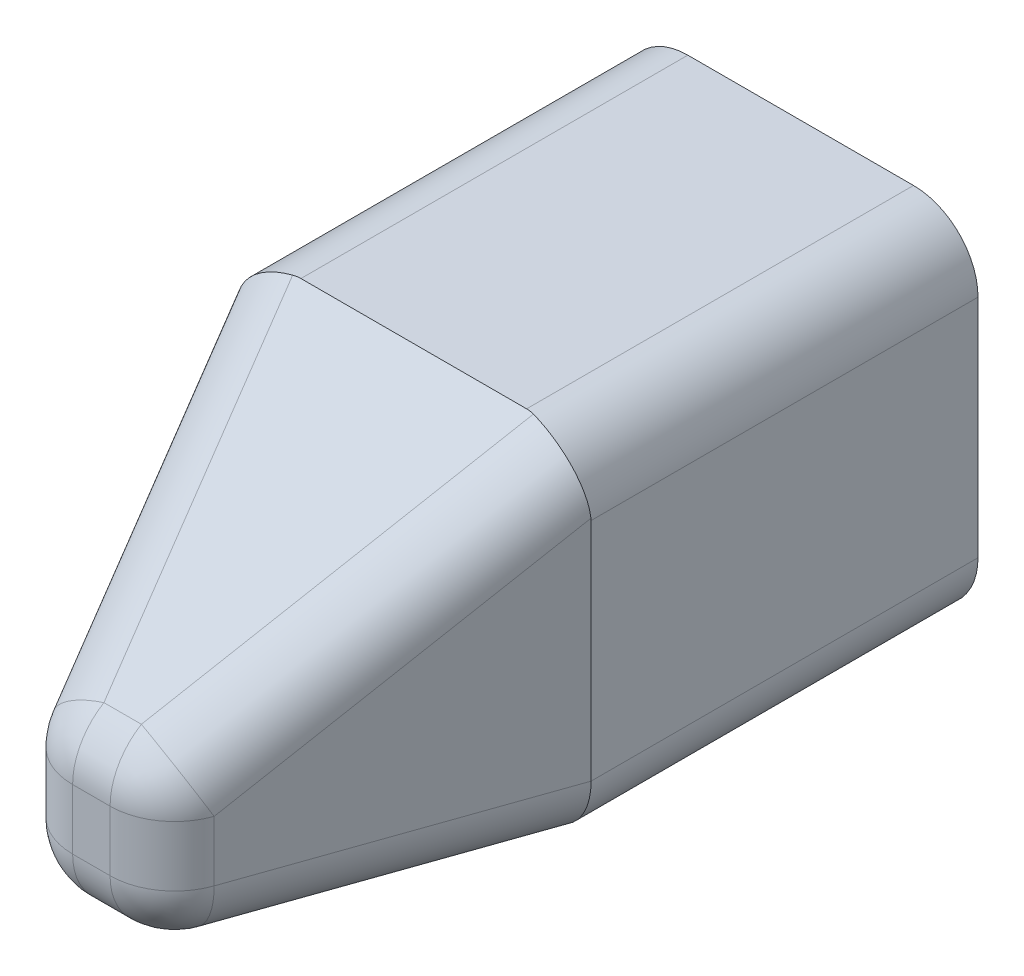
ISO-10303-21;
HEADER;
FILE_DESCRIPTION(('STEP AP214'),'2;1');
FILE_NAME('part.step','',(''),(''),'','','');
FILE_SCHEMA(('AUTOMOTIVE_DESIGN { 1 0 10303 214 1 1 1 1 }'));
ENDSEC;
DATA;
#1=APPLICATION_CONTEXT('core data for automotive mechanical design processes');
#2=APPLICATION_PROTOCOL_DEFINITION('international standard','automotive_design',2000,#1);
#3=PRODUCT_CONTEXT('',#1,'mechanical');
#4=PRODUCT('Part','Part','',(#3));
#5=PRODUCT_RELATED_PRODUCT_CATEGORY('part','',(#4));
#6=PRODUCT_DEFINITION_FORMATION('','',#4);
#7=PRODUCT_DEFINITION_CONTEXT('part definition',#1,'design');
#8=PRODUCT_DEFINITION('design','',#6,#7);
#9=PRODUCT_DEFINITION_SHAPE('','',#8);
#10=(LENGTH_UNIT() NAMED_UNIT(*) SI_UNIT(.MILLI.,.METRE.));
#11=(NAMED_UNIT(*) PLANE_ANGLE_UNIT() SI_UNIT($,.RADIAN.));
#12=(NAMED_UNIT(*) SI_UNIT($,.STERADIAN.) SOLID_ANGLE_UNIT());
#13=UNCERTAINTY_MEASURE_WITH_UNIT(LENGTH_MEASURE(1.E-05),#10,'distance_accuracy_value','');
#14=(GEOMETRIC_REPRESENTATION_CONTEXT(3) GLOBAL_UNCERTAINTY_ASSIGNED_CONTEXT((#13)) GLOBAL_UNIT_ASSIGNED_CONTEXT((#10,
#11,#12)) REPRESENTATION_CONTEXT('',''));
#15=CARTESIAN_POINT('',(0.,0.,0.));
#16=DIRECTION('',(0.,0.,1.));
#17=DIRECTION('',(1.,0.,0.));
#18=AXIS2_PLACEMENT_3D('',#15,#16,#17);
#19=CARTESIAN_POINT('',(0.,0.,100.));
#20=DIRECTION('',(0.,0.,1.));
#21=DIRECTION('',(1.,0.,0.));
#22=AXIS2_PLACEMENT_3D('',#19,#20,#21);
#23=PLANE('',#22);
#24=DIRECTION('',(0.,-1.,0.));
#25=VECTOR('',#24,1.);
#26=CARTESIAN_POINT('',(-5.81037989958291,0.,100.));
#27=LINE('',#26,#25);
#28=CARTESIAN_POINT('',(-5.81037989958291,38.6761924206188,100.));
#29=VERTEX_POINT('',#28);
#30=CARTESIAN_POINT('',(-5.81037989958291,20.,100.));
#31=VERTEX_POINT('',#30);
#32=EDGE_CURVE('E203',#29,#31,#27,.T.);
#33=ORIENTED_EDGE('',*,*,#32,.T.);
#34=DIRECTION('',(1.,0.,0.));
#35=VECTOR('',#34,1.);
#36=CARTESIAN_POINT('',(20.,20.,100.));
#37=LINE('',#36,#35);
#38=CARTESIAN_POINT('',(5.8103798995829,20.,100.));
#39=VERTEX_POINT('',#38);
#40=EDGE_CURVE('E184',#31,#39,#37,.T.);
#41=ORIENTED_EDGE('',*,*,#40,.T.);
#42=DIRECTION('',(0.,1.,0.));
#43=VECTOR('',#42,1.);
#44=CARTESIAN_POINT('',(5.81037989958291,50.,100.));
#45=LINE('',#44,#43);
#46=CARTESIAN_POINT('',(5.81037989958291,38.6761924206188,100.));
#47=VERTEX_POINT('',#46);
#48=EDGE_CURVE('E193',#39,#47,#45,.T.);
#49=ORIENTED_EDGE('',*,*,#48,.T.);
#50=DIRECTION('',(-1.,0.,0.));
#51=VECTOR('',#50,1.);
#52=CARTESIAN_POINT('',(-20.,38.6761924206188,100.));
#53=LINE('',#52,#51);
#54=EDGE_CURVE('E199',#47,#29,#53,.T.);
#55=ORIENTED_EDGE('',*,*,#54,.T.);
#56=EDGE_LOOP('',(#33,#41,#49,#55));
#57=FACE_BOUND('',#56,.T.);
#58=ADVANCED_FACE('F49',(#57),#23,.T.);
#59=CARTESIAN_POINT('',(0.,80.8823529411764,48.5294117647059));
#60=DIRECTION('',(0.,-0.857492925712544,-0.514495755427527));
#61=DIRECTION('',(0.,0.514495755427527,-0.857492925712544));
#62=AXIS2_PLACEMENT_3D('',#59,#60,#61);
#63=PLANE('',#62);
#64=DIRECTION('',(-1.,0.,0.));
#65=VECTOR('',#64,1.);
#66=CARTESIAN_POINT('',(-55.,110.,0.));
#67=LINE('',#66,#65);
#68=CARTESIAN_POINT('',(35.,110.,0.));
#69=VERTEX_POINT('',#68);
#70=CARTESIAN_POINT('',(-35.,110.,0.));
#71=VERTEX_POINT('',#70);
#72=EDGE_CURVE('E263',#69,#71,#67,.T.);
#73=ORIENTED_EDGE('',*,*,#72,.T.);
#74=CARTESIAN_POINT('',(-35.,90.,33.3333333333333));
#75=DIRECTION('',(0.,-0.857492925712544,-0.514495755427527));
#76=DIRECTION('',(0.,-0.514495755427527,0.857492925712544));
#77=AXIS2_PLACEMENT_3D('',#74,#75,#76);
#78=ELLIPSE('',#77,38.873012632302,20.);
#79=CARTESIAN_POINT('',(-37.3322539560543,109.863549317392,0.22741780434641));
#80=VERTEX_POINT('',#79);
#81=EDGE_CURVE('E12',#71,#80,#78,.F.);
#82=ORIENTED_EDGE('',*,*,#81,.T.);
#83=DIRECTION('',(0.287455546823614,-0.492780937411909,0.821301562353182));
#84=VECTOR('',#83,1.);
#85=CARTESIAN_POINT('',(-18.7386956189564,77.988877882367,53.3518701960549));
#86=LINE('',#85,#84);
#87=CARTESIAN_POINT('',(-5.8103798995829,55.8260509348697,90.2899151085505));
#88=VERTEX_POINT('',#87);
#89=EDGE_CURVE('E60',#80,#88,#86,.T.);
#90=ORIENTED_EDGE('',*,*,#89,.T.);
#91=DIRECTION('',(-1.,0.,0.));
#92=VECTOR('',#91,1.);
#93=CARTESIAN_POINT('',(20.,55.8260509348697,90.2899151085505));
#94=LINE('',#93,#92);
#95=CARTESIAN_POINT('',(5.8103798995829,55.8260509348697,90.2899151085505));
#96=VERTEX_POINT('',#95);
#97=EDGE_CURVE('E189',#88,#96,#94,.F.);
#98=ORIENTED_EDGE('',*,*,#97,.T.);
#99=DIRECTION('',(-0.287455546823614,-0.492780937411909,0.821301562353182));
#100=VECTOR('',#99,1.);
#101=CARTESIAN_POINT('',(18.7386956189564,77.988877882367,53.3518701960549));
#102=LINE('',#101,#100);
#103=CARTESIAN_POINT('',(37.3322539560543,109.863549317392,0.22741780434643));
#104=VERTEX_POINT('',#103);
#105=EDGE_CURVE('E73',#96,#104,#102,.F.);
#106=ORIENTED_EDGE('',*,*,#105,.T.);
#107=CARTESIAN_POINT('',(35.,90.,33.3333333333333));
#108=DIRECTION('',(0.,-0.857492925712544,-0.514495755427527));
#109=DIRECTION('',(0.,-0.514495755427527,0.857492925712544));
#110=AXIS2_PLACEMENT_3D('',#107,#108,#109);
#111=ELLIPSE('',#110,38.873012632302,20.);
#112=EDGE_CURVE('E279',#104,#69,#111,.F.);
#113=ORIENTED_EDGE('',*,*,#112,.T.);
#114=EDGE_LOOP('',(#73,#82,#90,#98,#106,#113));
#115=FACE_BOUND('',#114,.T.);
#116=ADVANCED_FACE('F237',(#115),#63,.F.);
#117=CARTESIAN_POINT('',(48.9977728285078,0.,17.1492204899777));
#118=DIRECTION('',(-0.943858356366017,0.,-0.330350424728106));
#119=DIRECTION('',(-0.330350424728106,0.,0.943858356366018));
#120=AXIS2_PLACEMENT_3D('',#117,#118,#119);
#121=PLANE('',#120);
#122=DIRECTION('',(0.,1.,0.));
#123=VECTOR('',#122,1.);
#124=CARTESIAN_POINT('',(24.6875470269032,0.,86.6070084945621));
#125=LINE('',#124,#123);
#126=CARTESIAN_POINT('',(24.6875470269033,38.6761924206188,86.6070084945621));
#127=VERTEX_POINT('',#126);
#128=CARTESIAN_POINT('',(24.6875470269032,20.,86.6070084945621));
#129=VERTEX_POINT('',#128);
#130=EDGE_CURVE('E204',#127,#129,#125,.F.);
#131=ORIENTED_EDGE('',*,*,#130,.T.);
#132=DIRECTION('',(-0.330350424728106,0.,0.943858356366018));
#133=VECTOR('',#132,1.);
#134=CARTESIAN_POINT('',(48.9977728285078,20.,17.1492204899777));
#135=LINE('',#134,#133);
#136=CARTESIAN_POINT('',(55.,20.,0.));
#137=VERTEX_POINT('',#136);
#138=EDGE_CURVE('E272',#129,#137,#135,.F.);
#139=ORIENTED_EDGE('',*,*,#138,.T.);
#140=DIRECTION('',(0.,1.,0.));
#141=VECTOR('',#140,1.);
#142=CARTESIAN_POINT('',(55.,0.,0.));
#143=LINE('',#142,#141);
#144=CARTESIAN_POINT('',(55.,90.,0.));
#145=VERTEX_POINT('',#144);
#146=EDGE_CURVE('E54',#137,#145,#143,.T.);
#147=ORIENTED_EDGE('',*,*,#146,.T.);
#148=CARTESIAN_POINT('',(35.,90.,57.1428571428572));
#149=DIRECTION('',(-0.943858356366017,0.,-0.330350424728106));
#150=DIRECTION('',(-0.330350424728106,0.,0.943858356366018));
#151=AXIS2_PLACEMENT_3D('',#148,#149,#150);
#152=ELLIPSE('',#151,60.5417717154774,20.);
#153=CARTESIAN_POINT('',(54.9902719417751,90.6237208461135,0.0277944520709547));
#154=VERTEX_POINT('',#153);
#155=EDGE_CURVE('E506',#145,#154,#152,.F.);
#156=ORIENTED_EDGE('',*,*,#155,.T.);
#157=DIRECTION('',(-0.287455546823614,-0.492780937411909,0.821301562353182));
#158=VECTOR('',#157,1.);
#159=CARTESIAN_POINT('',(37.6158627462767,60.8390193681161,49.6689635820665));
#160=LINE('',#159,#158);
#161=EDGE_CURVE('E507',#154,#127,#160,.T.);
#162=ORIENTED_EDGE('',*,*,#161,.T.);
#163=EDGE_LOOP('',(#131,#139,#147,#156,#162));
#164=FACE_BOUND('',#163,.T.);
#165=ADVANCED_FACE('F241',(#164),#121,.F.);
#166=CARTESIAN_POINT('',(-48.9977728285078,0.,17.1492204899777));
#167=DIRECTION('',(0.943858356366017,0.,-0.330350424728106));
#168=DIRECTION('',(-0.330350424728106,0.,-0.943858356366017));
#169=AXIS2_PLACEMENT_3D('',#166,#167,#168);
#170=PLANE('',#169);
#171=DIRECTION('',(0.,-1.,0.));
#172=VECTOR('',#171,1.);
#173=CARTESIAN_POINT('',(-55.,0.,0.));
#174=LINE('',#173,#172);
#175=CARTESIAN_POINT('',(-55.,90.,0.));
#176=VERTEX_POINT('',#175);
#177=CARTESIAN_POINT('',(-55.,20.,0.));
#178=VERTEX_POINT('',#177);
#179=EDGE_CURVE('E311',#176,#178,#174,.T.);
#180=ORIENTED_EDGE('',*,*,#179,.T.);
#181=DIRECTION('',(0.330350424728106,0.,0.943858356366017));
#182=VECTOR('',#181,1.);
#183=CARTESIAN_POINT('',(-48.9977728285078,20.,17.1492204899777));
#184=LINE('',#183,#182);
#185=CARTESIAN_POINT('',(-24.6875470269033,20.,86.6070084945621));
#186=VERTEX_POINT('',#185);
#187=EDGE_CURVE('E394',#178,#186,#184,.T.);
#188=ORIENTED_EDGE('',*,*,#187,.T.);
#189=DIRECTION('',(0.,-1.,0.));
#190=VECTOR('',#189,1.);
#191=CARTESIAN_POINT('',(-24.6875470269033,50.,86.6070084945621));
#192=LINE('',#191,#190);
#193=CARTESIAN_POINT('',(-24.6875470269033,38.6761924206188,86.6070084945621));
#194=VERTEX_POINT('',#193);
#195=EDGE_CURVE('E211',#186,#194,#192,.F.);
#196=ORIENTED_EDGE('',*,*,#195,.T.);
#197=DIRECTION('',(0.287455546823614,-0.492780937411909,0.821301562353182));
#198=VECTOR('',#197,1.);
#199=CARTESIAN_POINT('',(-37.6158627462767,60.8390193681161,49.6689635820665));
#200=LINE('',#199,#198);
#201=CARTESIAN_POINT('',(-54.9902719417752,90.6237208461135,0.0277944520709617));
#202=VERTEX_POINT('',#201);
#203=EDGE_CURVE('E390',#194,#202,#200,.F.);
#204=ORIENTED_EDGE('',*,*,#203,.T.);
#205=CARTESIAN_POINT('',(-35.,90.,57.1428571428572));
#206=DIRECTION('',(0.943858356366017,0.,-0.330350424728106));
#207=DIRECTION('',(0.330350424728106,0.,0.943858356366017));
#208=AXIS2_PLACEMENT_3D('',#205,#206,#207);
#209=ELLIPSE('',#208,60.5417717154774,20.);
#210=EDGE_CURVE('E392',#202,#176,#209,.F.);
#211=ORIENTED_EDGE('',*,*,#210,.T.);
#212=EDGE_LOOP('',(#180,#188,#196,#204,#211));
#213=FACE_BOUND('',#212,.T.);
#214=ADVANCED_FACE('F475',(#213),#170,.F.);
#215=CARTESIAN_POINT('',(0.,0.,0.));
#216=DIRECTION('',(0.,1.,0.));
#217=DIRECTION('',(-1.,0.,0.));
#218=AXIS2_PLACEMENT_3D('',#215,#216,#217);
#219=PLANE('',#218);
#220=DIRECTION('',(0.330350424728106,0.,0.943858356366017));
#221=VECTOR('',#220,1.);
#222=CARTESIAN_POINT('',(-30.1206057011874,0.,10.5422119954156));
#223=LINE('',#222,#221);
#224=CARTESIAN_POINT('',(-5.81037989958289,0.,80.));
#225=VERTEX_POINT('',#224);
#226=CARTESIAN_POINT('',(-35.,0.,-3.39891457262025));
#227=VERTEX_POINT('',#226);
#228=EDGE_CURVE('E378',#225,#227,#223,.F.);
#229=ORIENTED_EDGE('',*,*,#228,.T.);
#230=DIRECTION('',(0.,0.,1.));
#231=VECTOR('',#230,1.);
#232=CARTESIAN_POINT('',(-35.,0.,0.));
#233=LINE('',#232,#231);
#234=CARTESIAN_POINT('',(-35.,0.,-120.));
#235=VERTEX_POINT('',#234);
#236=EDGE_CURVE('E380',#227,#235,#233,.F.);
#237=ORIENTED_EDGE('',*,*,#236,.T.);
#238=DIRECTION('',(-1.,0.,0.));
#239=VECTOR('',#238,1.);
#240=CARTESIAN_POINT('',(55.,0.,-120.));
#241=LINE('',#240,#239);
#242=CARTESIAN_POINT('',(35.,0.,-120.));
#243=VERTEX_POINT('',#242);
#244=EDGE_CURVE('E292',#243,#235,#241,.T.);
#245=ORIENTED_EDGE('',*,*,#244,.F.);
#246=DIRECTION('',(0.,0.,1.));
#247=VECTOR('',#246,1.);
#248=CARTESIAN_POINT('',(35.,0.,0.));
#249=LINE('',#248,#247);
#250=CARTESIAN_POINT('',(35.,0.,-3.39891457262031));
#251=VERTEX_POINT('',#250);
#252=EDGE_CURVE('E376',#243,#251,#249,.T.);
#253=ORIENTED_EDGE('',*,*,#252,.T.);
#254=DIRECTION('',(-0.330350424728106,0.,0.943858356366018));
#255=VECTOR('',#254,1.);
#256=CARTESIAN_POINT('',(30.1206057011874,0.,10.5422119954156));
#257=LINE('',#256,#255);
#258=CARTESIAN_POINT('',(5.81037989958291,0.,80.));
#259=VERTEX_POINT('',#258);
#260=EDGE_CURVE('E372',#251,#259,#257,.T.);
#261=ORIENTED_EDGE('',*,*,#260,.T.);
#262=DIRECTION('',(1.,0.,0.));
#263=VECTOR('',#262,1.);
#264=CARTESIAN_POINT('',(-20.,0.,80.));
#265=LINE('',#264,#263);
#266=EDGE_CURVE('E187',#259,#225,#265,.F.);
#267=ORIENTED_EDGE('',*,*,#266,.T.);
#268=EDGE_LOOP('',(#229,#237,#245,#253,#261,#267));
#269=FACE_BOUND('',#268,.T.);
#270=ADVANCED_FACE('F438',(#269),#219,.F.);
#271=CARTESIAN_POINT('',(0.,38.6761924206188,80.));
#272=DIRECTION('',(1.,0.,0.));
#273=DIRECTION('',(0.,1.,0.));
#274=AXIS2_PLACEMENT_3D('',#271,#272,#273);
#275=CYLINDRICAL_SURFACE('',#274,20.);
#276=ORIENTED_EDGE('',*,*,#97,.F.);
#277=CARTESIAN_POINT('',(-5.81037989958291,38.6761924206188,80.));
#278=DIRECTION('',(1.,0.,0.));
#279=DIRECTION('',(0.,1.,0.));
#280=AXIS2_PLACEMENT_3D('',#277,#278,#279);
#281=CIRCLE('',#280,20.);
#282=EDGE_CURVE('E350',#88,#29,#281,.T.);
#283=ORIENTED_EDGE('',*,*,#282,.T.);
#284=ORIENTED_EDGE('',*,*,#54,.F.);
#285=CARTESIAN_POINT('',(5.81037989958291,38.6761924206188,80.));
#286=DIRECTION('',(1.,0.,0.));
#287=DIRECTION('',(0.,1.,0.));
#288=AXIS2_PLACEMENT_3D('',#285,#286,#287);
#289=CIRCLE('',#288,20.);
#290=EDGE_CURVE('E175',#47,#96,#289,.F.);
#291=ORIENTED_EDGE('',*,*,#290,.T.);
#292=EDGE_LOOP('',(#276,#283,#284,#291));
#293=FACE_BOUND('',#292,.T.);
#294=ADVANCED_FACE('F445',(#293),#275,.T.);
#295=CARTESIAN_POINT('',(-5.81037989958291,0.,80.));
#296=DIRECTION('',(0.,1.,0.));
#297=DIRECTION('',(0.,0.,1.));
#298=AXIS2_PLACEMENT_3D('',#295,#296,#297);
#299=CYLINDRICAL_SURFACE('',#298,20.);
#300=ORIENTED_EDGE('',*,*,#195,.F.);
#301=CARTESIAN_POINT('',(-5.81037989958291,20.,80.));
#302=DIRECTION('',(0.,1.,0.));
#303=DIRECTION('',(0.,0.,1.));
#304=AXIS2_PLACEMENT_3D('',#301,#302,#303);
#305=CIRCLE('',#304,20.);
#306=EDGE_CURVE('E346',#186,#31,#305,.T.);
#307=ORIENTED_EDGE('',*,*,#306,.T.);
#308=ORIENTED_EDGE('',*,*,#32,.F.);
#309=CARTESIAN_POINT('',(-5.81037989958291,38.6761924206188,80.));
#310=DIRECTION('',(0.,1.,0.));
#311=DIRECTION('',(0.,0.,1.));
#312=AXIS2_PLACEMENT_3D('',#309,#310,#311);
#313=CIRCLE('',#312,20.);
#314=EDGE_CURVE('E344',#29,#194,#313,.F.);
#315=ORIENTED_EDGE('',*,*,#314,.T.);
#316=EDGE_LOOP('',(#300,#307,#308,#315));
#317=FACE_BOUND('',#316,.T.);
#318=ADVANCED_FACE('F343',(#317),#299,.T.);
#319=CARTESIAN_POINT('',(5.8103798995829,0.,80.));
#320=DIRECTION('',(0.,-1.,0.));
#321=DIRECTION('',(1.,0.,0.));
#322=AXIS2_PLACEMENT_3D('',#319,#320,#321);
#323=CYLINDRICAL_SURFACE('',#322,20.);
#324=ORIENTED_EDGE('',*,*,#48,.F.);
#325=CARTESIAN_POINT('',(5.8103798995829,20.,80.));
#326=DIRECTION('',(0.,-1.,0.));
#327=DIRECTION('',(1.,0.,0.));
#328=AXIS2_PLACEMENT_3D('',#325,#326,#327);
#329=CIRCLE('',#328,20.);
#330=EDGE_CURVE('E165',#39,#129,#329,.F.);
#331=ORIENTED_EDGE('',*,*,#330,.T.);
#332=ORIENTED_EDGE('',*,*,#130,.F.);
#333=CARTESIAN_POINT('',(5.81037989958291,38.6761924206188,80.));
#334=DIRECTION('',(0.,-1.,0.));
#335=DIRECTION('',(1.,0.,0.));
#336=AXIS2_PLACEMENT_3D('',#333,#334,#335);
#337=CIRCLE('',#336,20.);
#338=EDGE_CURVE('E176',#127,#47,#337,.T.);
#339=ORIENTED_EDGE('',*,*,#338,.T.);
#340=EDGE_LOOP('',(#324,#331,#332,#339));
#341=FACE_BOUND('',#340,.T.);
#342=ADVANCED_FACE('F194',(#341),#323,.T.);
#343=CARTESIAN_POINT('',(0.,20.,80.));
#344=DIRECTION('',(-1.,0.,0.));
#345=DIRECTION('',(0.,-1.,0.));
#346=AXIS2_PLACEMENT_3D('',#343,#344,#345);
#347=CYLINDRICAL_SURFACE('',#346,20.);
#348=ORIENTED_EDGE('',*,*,#40,.F.);
#349=CARTESIAN_POINT('',(-5.81037989958291,20.,80.));
#350=DIRECTION('',(-1.,0.,0.));
#351=DIRECTION('',(0.,-1.,0.));
#352=AXIS2_PLACEMENT_3D('',#349,#350,#351);
#353=CIRCLE('',#352,20.);
#354=EDGE_CURVE('E188',#31,#225,#353,.F.);
#355=ORIENTED_EDGE('',*,*,#354,.T.);
#356=ORIENTED_EDGE('',*,*,#266,.F.);
#357=CARTESIAN_POINT('',(5.8103798995829,20.,80.));
#358=DIRECTION('',(-1.,0.,0.));
#359=DIRECTION('',(0.,-1.,0.));
#360=AXIS2_PLACEMENT_3D('',#357,#358,#359);
#361=CIRCLE('',#360,20.);
#362=EDGE_CURVE('E168',#259,#39,#361,.T.);
#363=ORIENTED_EDGE('',*,*,#362,.T.);
#364=EDGE_LOOP('',(#348,#355,#356,#363));
#365=FACE_BOUND('',#364,.T.);
#366=ADVANCED_FACE('F181',(#365),#347,.T.);
#367=CARTESIAN_POINT('',(-55.,0.,-120.));
#368=DIRECTION('',(1.,0.,0.));
#369=DIRECTION('',(0.,0.,-1.));
#370=AXIS2_PLACEMENT_3D('',#367,#368,#369);
#371=PLANE('',#370);
#372=DIRECTION('',(0.,1.,0.));
#373=VECTOR('',#372,1.);
#374=CARTESIAN_POINT('',(-55.,0.,-120.));
#375=LINE('',#374,#373);
#376=CARTESIAN_POINT('',(-55.,20.,-120.));
#377=VERTEX_POINT('',#376);
#378=CARTESIAN_POINT('',(-55.,90.,-120.));
#379=VERTEX_POINT('',#378);
#380=EDGE_CURVE('E480',#377,#379,#375,.T.);
#381=ORIENTED_EDGE('',*,*,#380,.F.);
#382=DIRECTION('',(0.,0.,1.));
#383=VECTOR('',#382,1.);
#384=CARTESIAN_POINT('',(-55.,20.,-120.));
#385=LINE('',#384,#383);
#386=EDGE_CURVE('E368',#377,#178,#385,.T.);
#387=ORIENTED_EDGE('',*,*,#386,.T.);
#388=ORIENTED_EDGE('',*,*,#179,.F.);
#389=DIRECTION('',(0.,0.,1.));
#390=VECTOR('',#389,1.);
#391=CARTESIAN_POINT('',(-55.,90.,-120.));
#392=LINE('',#391,#390);
#393=EDGE_CURVE('E360',#176,#379,#392,.F.);
#394=ORIENTED_EDGE('',*,*,#393,.T.);
#395=EDGE_LOOP('',(#381,#387,#388,#394));
#396=FACE_BOUND('',#395,.T.);
#397=ADVANCED_FACE('F224',(#396),#371,.F.);
#398=CARTESIAN_POINT('',(-55.,110.,-120.));
#399=DIRECTION('',(0.,-1.,0.));
#400=DIRECTION('',(0.,0.,-1.));
#401=AXIS2_PLACEMENT_3D('',#398,#399,#400);
#402=PLANE('',#401);
#403=DIRECTION('',(1.,0.,0.));
#404=VECTOR('',#403,1.);
#405=CARTESIAN_POINT('',(-55.,110.,-120.));
#406=LINE('',#405,#404);
#407=CARTESIAN_POINT('',(-35.,110.,-120.));
#408=VERTEX_POINT('',#407);
#409=CARTESIAN_POINT('',(35.,110.,-120.));
#410=VERTEX_POINT('',#409);
#411=EDGE_CURVE('E485',#408,#410,#406,.T.);
#412=ORIENTED_EDGE('',*,*,#411,.F.);
#413=DIRECTION('',(0.,0.,1.));
#414=VECTOR('',#413,1.);
#415=CARTESIAN_POINT('',(-35.,110.,-120.));
#416=LINE('',#415,#414);
#417=EDGE_CURVE('E271',#408,#71,#416,.T.);
#418=ORIENTED_EDGE('',*,*,#417,.T.);
#419=ORIENTED_EDGE('',*,*,#72,.F.);
#420=DIRECTION('',(0.,0.,1.));
#421=VECTOR('',#420,1.);
#422=CARTESIAN_POINT('',(35.,110.,-120.));
#423=LINE('',#422,#421);
#424=EDGE_CURVE('E269',#69,#410,#423,.F.);
#425=ORIENTED_EDGE('',*,*,#424,.T.);
#426=EDGE_LOOP('',(#412,#418,#419,#425));
#427=FACE_BOUND('',#426,.T.);
#428=ADVANCED_FACE('F233',(#427),#402,.F.);
#429=CARTESIAN_POINT('',(55.,110.,-120.));
#430=DIRECTION('',(-1.,0.,0.));
#431=DIRECTION('',(0.,0.,1.));
#432=AXIS2_PLACEMENT_3D('',#429,#430,#431);
#433=PLANE('',#432);
#434=ORIENTED_EDGE('',*,*,#146,.F.);
#435=DIRECTION('',(0.,0.,1.));
#436=VECTOR('',#435,1.);
#437=CARTESIAN_POINT('',(55.,20.,-120.));
#438=LINE('',#437,#436);
#439=CARTESIAN_POINT('',(55.,20.,-120.));
#440=VERTEX_POINT('',#439);
#441=EDGE_CURVE('E498',#137,#440,#438,.F.);
#442=ORIENTED_EDGE('',*,*,#441,.T.);
#443=DIRECTION('',(0.,-1.,0.));
#444=VECTOR('',#443,1.);
#445=CARTESIAN_POINT('',(55.,110.,-120.));
#446=LINE('',#445,#444);
#447=CARTESIAN_POINT('',(55.,90.,-120.));
#448=VERTEX_POINT('',#447);
#449=EDGE_CURVE('E487',#448,#440,#446,.T.);
#450=ORIENTED_EDGE('',*,*,#449,.F.);
#451=DIRECTION('',(0.,0.,1.));
#452=VECTOR('',#451,1.);
#453=CARTESIAN_POINT('',(55.,90.,-120.));
#454=LINE('',#453,#452);
#455=EDGE_CURVE('E398',#448,#145,#454,.T.);
#456=ORIENTED_EDGE('',*,*,#455,.T.);
#457=EDGE_LOOP('',(#434,#442,#450,#456));
#458=FACE_BOUND('',#457,.T.);
#459=ADVANCED_FACE('F412',(#458),#433,.F.);
#460=CARTESIAN_POINT('',(0.,0.,-120.));
#461=DIRECTION('',(0.,0.,-1.));
#462=DIRECTION('',(-1.,0.,0.));
#463=AXIS2_PLACEMENT_3D('',#460,#461,#462);
#464=PLANE('',#463);
#465=ORIENTED_EDGE('',*,*,#244,.T.);
#466=CARTESIAN_POINT('',(-35.,20.,-120.));
#467=DIRECTION('',(0.,0.,-1.));
#468=DIRECTION('',(-1.,0.,0.));
#469=AXIS2_PLACEMENT_3D('',#466,#467,#468);
#470=CIRCLE('',#469,20.);
#471=EDGE_CURVE('E388',#235,#377,#470,.T.);
#472=ORIENTED_EDGE('',*,*,#471,.T.);
#473=ORIENTED_EDGE('',*,*,#380,.T.);
#474=CARTESIAN_POINT('',(-35.,90.,-120.));
#475=DIRECTION('',(0.,0.,-1.));
#476=DIRECTION('',(-1.,0.,0.));
#477=AXIS2_PLACEMENT_3D('',#474,#475,#476);
#478=CIRCLE('',#477,20.);
#479=EDGE_CURVE('E384',#379,#408,#478,.T.);
#480=ORIENTED_EDGE('',*,*,#479,.T.);
#481=ORIENTED_EDGE('',*,*,#411,.T.);
#482=CARTESIAN_POINT('',(35.,90.,-120.));
#483=DIRECTION('',(0.,0.,-1.));
#484=DIRECTION('',(-1.,0.,0.));
#485=AXIS2_PLACEMENT_3D('',#482,#483,#484);
#486=CIRCLE('',#485,20.);
#487=EDGE_CURVE('E382',#410,#448,#486,.T.);
#488=ORIENTED_EDGE('',*,*,#487,.T.);
#489=ORIENTED_EDGE('',*,*,#449,.T.);
#490=CARTESIAN_POINT('',(35.,20.,-120.));
#491=DIRECTION('',(0.,0.,-1.));
#492=DIRECTION('',(-1.,0.,0.));
#493=AXIS2_PLACEMENT_3D('',#490,#491,#492);
#494=CIRCLE('',#493,20.);
#495=EDGE_CURVE('E386',#440,#243,#494,.T.);
#496=ORIENTED_EDGE('',*,*,#495,.T.);
#497=EDGE_LOOP('',(#465,#472,#473,#480,#481,#488,#489,#496));
#498=FACE_BOUND('',#497,.T.);
#499=ADVANCED_FACE('F421',(#498),#464,.T.);
#500=CARTESIAN_POINT('',(-35.,20.,-120.));
#501=DIRECTION('',(0.,0.,1.));
#502=DIRECTION('',(0.,-1.,0.));
#503=AXIS2_PLACEMENT_3D('',#500,#501,#502);
#504=CYLINDRICAL_SURFACE('',#503,20.);
#505=ORIENTED_EDGE('',*,*,#471,.F.);
#506=ORIENTED_EDGE('',*,*,#236,.F.);
#507=CARTESIAN_POINT('',(-35.,20.,-3.39891457262029));
#508=DIRECTION('',(0.167543492314656,0.,0.985864685533978));
#509=DIRECTION('',(0.985864685533978,0.,-0.167543492314656));
#510=AXIS2_PLACEMENT_3D('',#507,#508,#509);
#511=ELLIPSE('',#510,20.2867597282555,20.);
#512=EDGE_CURVE('E288',#178,#227,#511,.T.);
#513=ORIENTED_EDGE('',*,*,#512,.F.);
#514=ORIENTED_EDGE('',*,*,#386,.F.);
#515=EDGE_LOOP('',(#505,#506,#513,#514));
#516=FACE_BOUND('',#515,.T.);
#517=ADVANCED_FACE('F423',(#516),#504,.T.);
#518=CARTESIAN_POINT('',(-30.1206057011874,20.,10.5422119954156));
#519=DIRECTION('',(0.330350424728106,0.,0.943858356366017));
#520=DIRECTION('',(0.943858356366017,0.,-0.330350424728106));
#521=AXIS2_PLACEMENT_3D('',#518,#519,#520);
#522=CYLINDRICAL_SURFACE('',#521,20.);
#523=CARTESIAN_POINT('',(-5.81037989958291,20.,80.));
#524=DIRECTION('',(0.330350424728106,0.,0.943858356366017));
#525=DIRECTION('',(0.943858356366018,0.,-0.330350424728106));
#526=AXIS2_PLACEMENT_3D('',#523,#524,#525);
#527=CIRCLE('',#526,20.);
#528=EDGE_CURVE('E286',#186,#225,#527,.T.);
#529=ORIENTED_EDGE('',*,*,#528,.F.);
#530=ORIENTED_EDGE('',*,*,#187,.F.);
#531=ORIENTED_EDGE('',*,*,#512,.T.);
#532=ORIENTED_EDGE('',*,*,#228,.F.);
#533=EDGE_LOOP('',(#529,#530,#531,#532));
#534=FACE_BOUND('',#533,.T.);
#535=ADVANCED_FACE('F428',(#534),#522,.T.);
#536=CARTESIAN_POINT('',(-5.81037989958291,20.,80.));
#537=DIRECTION('',(0.,0.,1.));
#538=DIRECTION('',(1.,0.,0.));
#539=AXIS2_PLACEMENT_3D('',#536,#537,#538);
#540=SPHERICAL_SURFACE('',#539,20.);
#541=ORIENTED_EDGE('',*,*,#354,.F.);
#542=ORIENTED_EDGE('',*,*,#306,.F.);
#543=ORIENTED_EDGE('',*,*,#528,.T.);
#544=EDGE_LOOP('',(#541,#542,#543));
#545=FACE_BOUND('',#544,.T.);
#546=ADVANCED_FACE('F448',(#545),#540,.T.);
#547=CARTESIAN_POINT('',(35.,20.,0.));
#548=DIRECTION('',(0.,0.,1.));
#549=DIRECTION('',(0.,-1.,0.));
#550=AXIS2_PLACEMENT_3D('',#547,#548,#549);
#551=CYLINDRICAL_SURFACE('',#550,20.);
#552=ORIENTED_EDGE('',*,*,#495,.F.);
#553=ORIENTED_EDGE('',*,*,#441,.F.);
#554=CARTESIAN_POINT('',(35.,20.,-3.39891457262031));
#555=DIRECTION('',(-0.167543492314656,0.,0.985864685533978));
#556=DIRECTION('',(-0.985864685533978,0.,-0.167543492314656));
#557=AXIS2_PLACEMENT_3D('',#554,#555,#556);
#558=ELLIPSE('',#557,20.2867597282555,20.);
#559=EDGE_CURVE('E289',#251,#137,#558,.T.);
#560=ORIENTED_EDGE('',*,*,#559,.F.);
#561=ORIENTED_EDGE('',*,*,#252,.F.);
#562=EDGE_LOOP('',(#552,#553,#560,#561));
#563=FACE_BOUND('',#562,.T.);
#564=ADVANCED_FACE('F451',(#563),#551,.T.);
#565=CARTESIAN_POINT('',(30.1206057011874,20.,10.5422119954156));
#566=DIRECTION('',(-0.330350424728106,0.,0.943858356366018));
#567=DIRECTION('',(0.943858356366017,0.,0.330350424728106));
#568=AXIS2_PLACEMENT_3D('',#565,#566,#567);
#569=CYLINDRICAL_SURFACE('',#568,20.);
#570=CARTESIAN_POINT('',(5.8103798995829,20.,80.));
#571=DIRECTION('',(-0.330350424728106,0.,0.943858356366018));
#572=DIRECTION('',(0.943858356366018,0.,0.330350424728106));
#573=AXIS2_PLACEMENT_3D('',#570,#571,#572);
#574=CIRCLE('',#573,20.);
#575=EDGE_CURVE('E170',#259,#129,#574,.T.);
#576=ORIENTED_EDGE('',*,*,#575,.F.);
#577=ORIENTED_EDGE('',*,*,#260,.F.);
#578=ORIENTED_EDGE('',*,*,#559,.T.);
#579=ORIENTED_EDGE('',*,*,#138,.F.);
#580=EDGE_LOOP('',(#576,#577,#578,#579));
#581=FACE_BOUND('',#580,.T.);
#582=ADVANCED_FACE('F458',(#581),#569,.T.);
#583=CARTESIAN_POINT('',(5.8103798995829,20.,80.));
#584=DIRECTION('',(0.,0.,1.));
#585=DIRECTION('',(1.,0.,0.));
#586=AXIS2_PLACEMENT_3D('',#583,#584,#585);
#587=SPHERICAL_SURFACE('',#586,20.);
#588=ORIENTED_EDGE('',*,*,#575,.T.);
#589=ORIENTED_EDGE('',*,*,#330,.F.);
#590=ORIENTED_EDGE('',*,*,#362,.F.);
#591=EDGE_LOOP('',(#588,#589,#590));
#592=FACE_BOUND('',#591,.T.);
#593=ADVANCED_FACE('F167',(#592),#587,.T.);
#594=CARTESIAN_POINT('',(-35.,90.,-120.));
#595=DIRECTION('',(0.,0.,1.));
#596=DIRECTION('',(1.,0.,0.));
#597=AXIS2_PLACEMENT_3D('',#594,#595,#596);
#598=CYLINDRICAL_SURFACE('',#597,20.);
#599=ORIENTED_EDGE('',*,*,#393,.F.);
#600=ORIENTED_EDGE('',*,*,#210,.F.);
#601=CARTESIAN_POINT('',(-37.3322539560543,109.863549317392,0.227417804346411));
#602=CARTESIAN_POINT('',(-37.596499367809,109.832524445672,0.279126846804721));
#603=CARTESIAN_POINT('',(-37.8604459733113,109.79618595576,0.329028153560507));
#604=CARTESIAN_POINT('',(-38.387312291239,109.712870179103,0.425228496313744));
#605=CARTESIAN_POINT('',(-38.6502320108069,109.66589296649,0.471527557409099));
#606=CARTESIAN_POINT('',(-39.4367300638645,109.509001579283,0.605028231493654));
#607=CARTESIAN_POINT('',(-39.9581305911998,109.383117913609,0.686849574556827));
#608=CARTESIAN_POINT('',(-40.9907137965018,109.089246280398,0.836086792455252));
#609=CARTESIAN_POINT('',(-41.5019021782739,108.92128256854,0.903510924766457));
#610=CARTESIAN_POINT('',(-42.2582244752225,108.638419713598,0.99393215928463));
#611=CARTESIAN_POINT('',(-42.5085943750768,108.538976473528,1.02228729197129));
#612=CARTESIAN_POINT('',(-43.0054956552613,108.329885870402,1.0754576259913));
#613=CARTESIAN_POINT('',(-43.252026022955,108.220235866889,1.10027190708902));
#614=CARTESIAN_POINT('',(-43.9854772011041,107.876044158309,1.16945920424002));
#615=CARTESIAN_POINT('',(-44.4659092550854,107.626391126748,1.20853516895157));
#616=CARTESIAN_POINT('',(-45.4056241733755,107.08847829835,1.27278852700607));
#617=CARTESIAN_POINT('',(-45.8649070688978,106.800218558494,1.29796594086217));
#618=CARTESIAN_POINT('',(-46.5352488684738,106.340486412127,1.32559180680464));
#619=CARTESIAN_POINT('',(-46.7555910287797,106.182691785969,1.33311029329584));
#620=CARTESIAN_POINT('',(-47.1896822002321,105.858280265304,1.34483221660301));
#621=CARTESIAN_POINT('',(-47.4034329009033,105.691665661787,1.34903650981577));
#622=CARTESIAN_POINT('',(-48.0343226543304,105.178932971435,1.35677898819168));
#623=CARTESIAN_POINT('',(-48.4411480443507,104.819892610692,1.35544874367029));
#624=CARTESIAN_POINT('',(-49.2214972933971,104.072633489804,1.34051589895741));
#625=CARTESIAN_POINT('',(-49.5952253712731,103.684625562822,1.32699530136227));
#626=CARTESIAN_POINT('',(-50.3099320118786,102.880041984293,1.28862023982282));
#627=CARTESIAN_POINT('',(-50.6509104910339,102.463466259848,1.26376574695628));
#628=CARTESIAN_POINT('',(-51.2980410401599,101.604447986688,1.20371153171336));
#629=CARTESIAN_POINT('',(-51.6041738495681,101.161991335145,1.16850612613172));
#630=CARTESIAN_POINT('',(-52.1794796114708,100.25446866235,1.08897527812396));
#631=CARTESIAN_POINT('',(-52.448653000211,99.7894029080488,1.04464994335915));
#632=CARTESIAN_POINT('',(-52.9531004389269,98.8309073357254,0.947452933329641));
#633=CARTESIAN_POINT('',(-53.1876491575216,98.3371104176624,0.894437367098889));
#634=CARTESIAN_POINT('',(-53.6153781644196,97.3325156132284,0.78236535101999));
#635=CARTESIAN_POINT('',(-53.8085533393857,96.8217156344602,0.723308155820943));
#636=CARTESIAN_POINT('',(-54.1522134531588,95.7870188317493,0.60160926238737));
#637=CARTESIAN_POINT('',(-54.302745574601,95.2631371862736,0.538971618747476));
#638=CARTESIAN_POINT('',(-54.5605064432075,94.2051067196068,0.413129466995054));
#639=CARTESIAN_POINT('',(-54.6677530387696,93.6709622255847,0.349925203535184));
#640=CARTESIAN_POINT('',(-54.8189086877008,92.7180088600504,0.241088086180989));
#641=CARTESIAN_POINT('',(-54.8716841245208,92.3006751525001,0.194734975305549));
#642=CARTESIAN_POINT('',(-54.9310253159936,91.6728225507685,0.128799404765099));
#643=CARTESIAN_POINT('',(-54.9474968649377,91.4633952214146,0.107435300812056));
#644=CARTESIAN_POINT('',(-54.9738407134112,91.0439551640242,0.0663083910985609));
#645=CARTESIAN_POINT('',(-54.9837125627492,90.8339423970336,0.0465456946572008));
#646=CARTESIAN_POINT('',(-54.9902719417752,90.6237208461135,0.0277944520709768));
#647=B_SPLINE_CURVE_WITH_KNOTS('',3,(#601,#602,#603,#604,#605,#606,#607,#608,#609,#610,#611,
#612,#613,#614,#615,#616,#617,#618,#619,#620,#621,#622,#623,#624,#625,#626,#627,#628,#629,#630,
#631,#632,#633,#634,#635,#636,#637,#638,#639,#640,#641,#642,#643,#644,#645,#646),.UNSPECIFIED.,
.F.,.F.,(4,2,2,2,2,2,2,2,2,2,2,2,2,2,2,2,2,2,2,2,2,2,4),(0.,0.813001123901735,1.62599658287815,
3.25173204037994,4.87653254278569,5.68897154992059,6.50162131961404,8.12804127977044,
9.75445883945663,10.5676058562685,11.3805426846835,13.0062397042098,14.6210818426016,
16.2359281018269,17.851662659139,19.4673781437021,21.1132077522574,22.7592406509073,
24.4034451099149,26.0469709016381,27.3157123468263,27.9490869264181,28.5825047065726),.UNSPECIFIED.);
#648=EDGE_CURVE('E296',#80,#202,#647,.T.);
#649=ORIENTED_EDGE('',*,*,#648,.F.);
#650=ORIENTED_EDGE('',*,*,#81,.F.);
#651=ORIENTED_EDGE('',*,*,#417,.F.);
#652=ORIENTED_EDGE('',*,*,#479,.F.);
#653=EDGE_LOOP('',(#599,#600,#649,#650,#651,#652));
#654=FACE_BOUND('',#653,.T.);
#655=ADVANCED_FACE('F317',(#654),#598,.T.);
#656=CARTESIAN_POINT('',(-18.7386956189564,60.8390193681161,43.0619550875044));
#657=DIRECTION('',(0.287455546823614,-0.492780937411909,0.821301562353182));
#658=DIRECTION('',(0.,-0.857492925712544,-0.514495755427526));
#659=AXIS2_PLACEMENT_3D('',#656,#657,#658);
#660=CYLINDRICAL_SURFACE('',#659,20.);
#661=CARTESIAN_POINT('',(-5.81037989958291,38.6761924206188,80.));
#662=DIRECTION('',(0.287455546823614,-0.492780937411909,0.821301562353181));
#663=DIRECTION('',(0.,-0.857492925712544,-0.514495755427527));
#664=AXIS2_PLACEMENT_3D('',#661,#662,#663);
#665=CIRCLE('',#664,20.);
#666=EDGE_CURVE('E301',#88,#194,#665,.T.);
#667=ORIENTED_EDGE('',*,*,#666,.F.);
#668=ORIENTED_EDGE('',*,*,#89,.F.);
#669=ORIENTED_EDGE('',*,*,#648,.T.);
#670=ORIENTED_EDGE('',*,*,#203,.F.);
#671=EDGE_LOOP('',(#667,#668,#669,#670));
#672=FACE_BOUND('',#671,.T.);
#673=ADVANCED_FACE('F314',(#672),#660,.T.);
#674=CARTESIAN_POINT('',(-5.81037989958291,38.6761924206188,80.));
#675=DIRECTION('',(0.,0.,1.));
#676=DIRECTION('',(1.,0.,0.));
#677=AXIS2_PLACEMENT_3D('',#674,#675,#676);
#678=SPHERICAL_SURFACE('',#677,20.);
#679=ORIENTED_EDGE('',*,*,#314,.F.);
#680=ORIENTED_EDGE('',*,*,#282,.F.);
#681=ORIENTED_EDGE('',*,*,#666,.T.);
#682=EDGE_LOOP('',(#679,#680,#681));
#683=FACE_BOUND('',#682,.T.);
#684=ADVANCED_FACE('F349',(#683),#678,.T.);
#685=CARTESIAN_POINT('',(35.,90.,-120.));
#686=DIRECTION('',(0.,0.,1.));
#687=DIRECTION('',(1.,0.,0.));
#688=AXIS2_PLACEMENT_3D('',#685,#686,#687);
#689=CYLINDRICAL_SURFACE('',#688,20.);
#690=ORIENTED_EDGE('',*,*,#424,.F.);
#691=ORIENTED_EDGE('',*,*,#112,.F.);
#692=CARTESIAN_POINT('',(54.9902719417752,90.6237208461135,0.0277944520709559));
#693=CARTESIAN_POINT('',(54.9814860557887,90.9053429694352,0.0529373669596358));
#694=CARTESIAN_POINT('',(54.9667521507024,91.1866066283502,0.0798618782691246));
#695=CARTESIAN_POINT('',(54.9254546516016,91.7479864345577,0.136334605641644));
#696=CARTESIAN_POINT('',(54.8988916789921,92.0281026413482,0.165882683818086));
#697=CARTESIAN_POINT('',(54.83400403312,92.5867644566118,0.226663482520613));
#698=CARTESIAN_POINT('',(54.7956802937512,92.8653101880047,0.257896069121746));
#699=CARTESIAN_POINT('',(54.707352947034,93.4204168803898,0.321326260903201));
#700=CARTESIAN_POINT('',(54.6573491817964,93.6969778144997,0.353523879123581));
#701=CARTESIAN_POINT('',(54.4898739179289,94.5233544157071,0.450648632088402));
#702=CARTESIAN_POINT('',(54.3549592810923,95.069684790984,0.516087401451133));
#703=CARTESIAN_POINT('',(54.0395140214482,96.149246523614,0.644398770224445));
#704=CARTESIAN_POINT('',(53.8589834831622,96.6824779052361,0.707271374389605));
#705=CARTESIAN_POINT('',(53.4532411122045,97.7327187911043,0.827613760846458));
#706=CARTESIAN_POINT('',(53.2280010504967,98.2497178063569,0.885080095725594));
#707=CARTESIAN_POINT('',(52.7343022003473,99.2634984857682,0.992280164883435));
#708=CARTESIAN_POINT('',(52.4658431796967,99.7602800412836,1.042013857613));
#709=CARTESIAN_POINT('',(51.8876504314345,100.729655949294,1.13188149761237));
#710=CARTESIAN_POINT('',(51.5779464401988,101.202267391103,1.17202230333827));
#711=CARTESIAN_POINT('',(50.9192307694347,102.120113992587,1.24125058500384));
#712=CARTESIAN_POINT('',(50.5702200123583,102.565349794335,1.2703383202671));
#713=CARTESIAN_POINT('',(49.8420281522847,103.417245661248,1.31581832849909));
#714=CARTESIAN_POINT('',(49.4635065222792,103.824457584966,1.33243060153511));
#715=CARTESIAN_POINT('',(48.6737104494443,104.606107324761,1.35287076006853));
#716=CARTESIAN_POINT('',(48.2624359982672,104.980545132486,1.35669864230758));
#717=CARTESIAN_POINT('',(47.4099226309213,105.694037217848,1.35080901335809));
#718=CARTESIAN_POINT('',(46.9686698601321,106.033074949016,1.34108519812081));
#719=CARTESIAN_POINT('',(46.2872054771726,106.512912009095,1.31590796174067));
#720=CARTESIAN_POINT('',(46.0567794464134,106.668075228046,1.30574984495905));
#721=CARTESIAN_POINT('',(45.5897375982611,106.968635369692,1.28184433201559));
#722=CARTESIAN_POINT('',(45.3531201997789,107.114029763227,1.26809601081332));
#723=CARTESIAN_POINT('',(44.647724771866,107.527491253573,1.22223342767422));
#724=CARTESIAN_POINT('',(44.1709732904518,107.781563232034,1.18504495424679));
#725=CARTESIAN_POINT('',(43.1995573538094,108.249876721662,1.09661324507121));
#726=CARTESIAN_POINT('',(42.7048930969847,108.464118673828,1.04537016495187));
#727=CARTESIAN_POINT('',(41.9526769270432,108.75453221483,0.957900226094207));
#728=CARTESIAN_POINT('',(41.7003677456566,108.846139191689,0.926994706811106));
#729=CARTESIAN_POINT('',(41.1927495857928,109.018983619081,0.86163868818794));
#730=CARTESIAN_POINT('',(40.9374413255507,109.100223499237,0.827189022882013));
#731=CARTESIAN_POINT('',(40.1678108470155,109.328211935903,0.718519497036571));
#732=CARTESIAN_POINT('',(39.6494850904439,109.459344104523,0.638944631139242));
#733=CARTESIAN_POINT('',(38.8301233256084,109.632192580345,0.502726456494411));
#734=CARTESIAN_POINT('',(38.5311825137674,109.688142780911,0.450874456965544));
#735=CARTESIAN_POINT('',(37.9323765548547,109.786183109227,0.342594134777454));
#736=CARTESIAN_POINT('',(37.6325137113068,109.828295698975,0.286173415790202));
#737=CARTESIAN_POINT('',(37.3322539560543,109.863549317392,0.227417804346433));
#738=B_SPLINE_CURVE_WITH_KNOTS('',3,(#692,#693,#694,#695,#696,#697,#698,#699,#700,#701,#702,
#703,#704,#705,#706,#707,#708,#709,#710,#711,#712,#713,#714,#715,#716,#717,#718,#719,#720,#721,
#722,#723,#724,#725,#726,#727,#728,#729,#730,#731,#732,#733,#734,#735,#736,#737),.UNSPECIFIED.,
.F.,.F.,(4,2,2,2,2,2,2,2,2,2,2,2,2,2,2,2,2,2,2,2,2,2,4),(0.,0.848547052423738,1.69704953419791,
2.54548465589115,3.39393124729575,5.09136701945926,6.78879964647918,8.4873074400109,
10.1858243596718,11.8831232633469,13.5803823430808,15.2469586965536,16.9135354747845,
18.5808877786475,19.4146127434286,20.2485527354001,21.8710043320853,23.4934379638405,
24.303818792938,25.1140093516821,26.7334302321479,27.6586945809532,28.5824494815604),.UNSPECIFIED.);
#739=EDGE_CURVE('E303',#154,#104,#738,.T.);
#740=ORIENTED_EDGE('',*,*,#739,.F.);
#741=ORIENTED_EDGE('',*,*,#155,.F.);
#742=ORIENTED_EDGE('',*,*,#455,.F.);
#743=ORIENTED_EDGE('',*,*,#487,.F.);
#744=EDGE_LOOP('',(#690,#691,#740,#741,#742,#743));
#745=FACE_BOUND('',#744,.T.);
#746=ADVANCED_FACE('F51',(#745),#689,.T.);
#747=CARTESIAN_POINT('',(18.7386956189564,60.8390193681161,43.0619550875044));
#748=DIRECTION('',(-0.287455546823614,-0.492780937411909,0.821301562353182));
#749=DIRECTION('',(0.,-0.857492925712544,-0.514495755427527));
#750=AXIS2_PLACEMENT_3D('',#747,#748,#749);
#751=CYLINDRICAL_SURFACE('',#750,20.);
#752=CARTESIAN_POINT('',(5.81037989958291,38.6761924206188,80.));
#753=DIRECTION('',(-0.287455546823614,-0.49278093741191,0.821301562353182));
#754=DIRECTION('',(0.,-0.857492925712544,-0.514495755427527));
#755=AXIS2_PLACEMENT_3D('',#752,#753,#754);
#756=CIRCLE('',#755,20.);
#757=EDGE_CURVE('E334',#127,#96,#756,.T.);
#758=ORIENTED_EDGE('',*,*,#757,.F.);
#759=ORIENTED_EDGE('',*,*,#161,.F.);
#760=ORIENTED_EDGE('',*,*,#739,.T.);
#761=ORIENTED_EDGE('',*,*,#105,.F.);
#762=EDGE_LOOP('',(#758,#759,#760,#761));
#763=FACE_BOUND('',#762,.T.);
#764=ADVANCED_FACE('F324',(#763),#751,.T.);
#765=CARTESIAN_POINT('',(5.81037989958291,38.6761924206188,80.));
#766=DIRECTION('',(0.,0.,1.));
#767=DIRECTION('',(1.,0.,0.));
#768=AXIS2_PLACEMENT_3D('',#765,#766,#767);
#769=SPHERICAL_SURFACE('',#768,20.);
#770=ORIENTED_EDGE('',*,*,#757,.T.);
#771=ORIENTED_EDGE('',*,*,#290,.F.);
#772=ORIENTED_EDGE('',*,*,#338,.F.);
#773=EDGE_LOOP('',(#770,#771,#772));
#774=FACE_BOUND('',#773,.T.);
#775=ADVANCED_FACE('F322',(#774),#769,.T.);
#776=CLOSED_SHELL('',(#58,#116,#165,#214,#270,#294,#318,#342,#366,#397,#428,#459,#499,#517,#535,
#546,#564,#582,#593,#655,#673,#684,#746,#764,#775));
#777=MANIFOLD_SOLID_BREP('B2',#776);
#778=ADVANCED_BREP_SHAPE_REPRESENTATION('',(#18,#777),#14);
#779=SHAPE_DEFINITION_REPRESENTATION(#9,#778);
ENDSEC;
END-ISO-10303-21;
